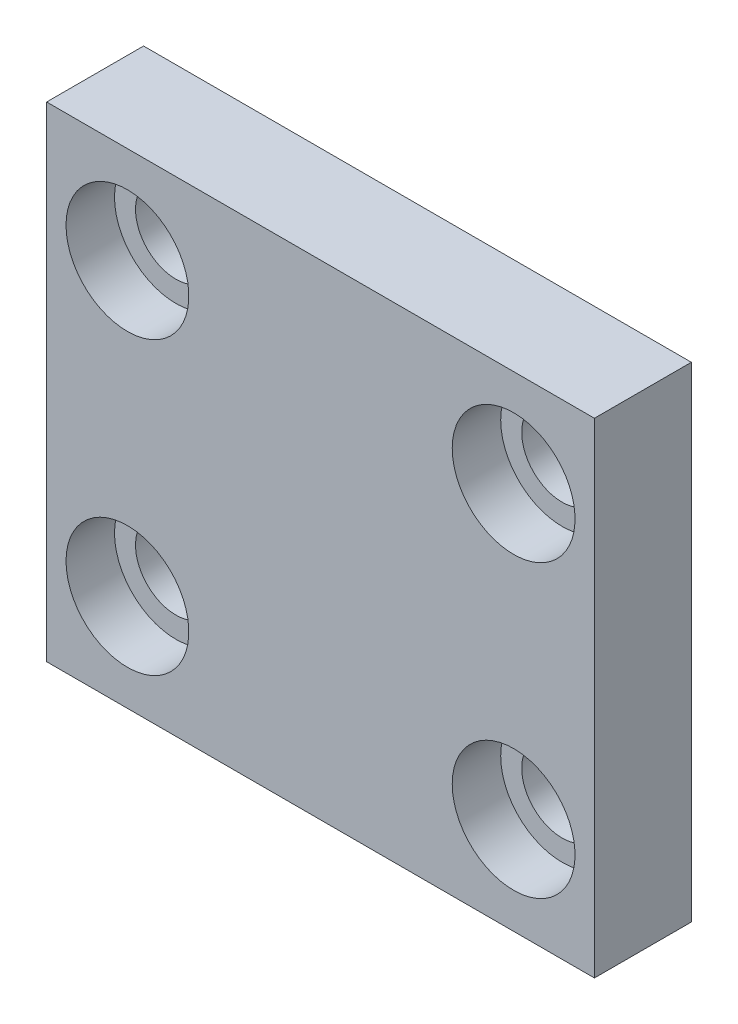
ISO-10303-21;
HEADER;
FILE_DESCRIPTION(('STEP AP214'),'2;1');
FILE_NAME('part.step','',(''),(''),'','','');
FILE_SCHEMA(('AUTOMOTIVE_DESIGN { 1 0 10303 214 1 1 1 1 }'));
ENDSEC;
DATA;
#1=APPLICATION_CONTEXT('core data for automotive mechanical design processes');
#2=APPLICATION_PROTOCOL_DEFINITION('international standard','automotive_design',2000,#1);
#3=PRODUCT_CONTEXT('',#1,'mechanical');
#4=PRODUCT('Part','Part','',(#3));
#5=PRODUCT_RELATED_PRODUCT_CATEGORY('part','',(#4));
#6=PRODUCT_DEFINITION_FORMATION('','',#4);
#7=PRODUCT_DEFINITION_CONTEXT('part definition',#1,'design');
#8=PRODUCT_DEFINITION('design','',#6,#7);
#9=PRODUCT_DEFINITION_SHAPE('','',#8);
#10=(LENGTH_UNIT() NAMED_UNIT(*) SI_UNIT(.MILLI.,.METRE.));
#11=(NAMED_UNIT(*) PLANE_ANGLE_UNIT() SI_UNIT($,.RADIAN.));
#12=(NAMED_UNIT(*) SI_UNIT($,.STERADIAN.) SOLID_ANGLE_UNIT());
#13=UNCERTAINTY_MEASURE_WITH_UNIT(LENGTH_MEASURE(1.E-05),#10,'distance_accuracy_value','');
#14=(GEOMETRIC_REPRESENTATION_CONTEXT(3) GLOBAL_UNCERTAINTY_ASSIGNED_CONTEXT((#13)) GLOBAL_UNIT_ASSIGNED_CONTEXT((#10,
#11,#12)) REPRESENTATION_CONTEXT('',''));
#15=CARTESIAN_POINT('',(0.,0.,0.));
#16=DIRECTION('',(0.,0.,1.));
#17=DIRECTION('',(1.,0.,0.));
#18=AXIS2_PLACEMENT_3D('',#15,#16,#17);
#19=CARTESIAN_POINT('',(16.95,-15.,3.));
#20=DIRECTION('',(-1.,0.,0.));
#21=DIRECTION('',(0.,0.,1.));
#22=AXIS2_PLACEMENT_3D('',#19,#20,#21);
#23=PLANE('',#22);
#24=DIRECTION('',(0.,1.,0.));
#25=VECTOR('',#24,1.);
#26=CARTESIAN_POINT('',(16.95,-15.,0.));
#27=LINE('',#26,#25);
#28=CARTESIAN_POINT('',(16.95,-15.,0.));
#29=VERTEX_POINT('',#28);
#30=CARTESIAN_POINT('',(16.95,15.,0.));
#31=VERTEX_POINT('',#30);
#32=EDGE_CURVE('E89',#29,#31,#27,.T.);
#33=ORIENTED_EDGE('',*,*,#32,.T.);
#34=DIRECTION('',(0.,0.,-1.));
#35=VECTOR('',#34,1.);
#36=CARTESIAN_POINT('',(16.95,15.,3.));
#37=LINE('',#36,#35);
#38=CARTESIAN_POINT('',(16.95,15.,6.));
#39=VERTEX_POINT('',#38);
#40=EDGE_CURVE('E11',#39,#31,#37,.T.);
#41=ORIENTED_EDGE('',*,*,#40,.F.);
#42=DIRECTION('',(0.,1.,0.));
#43=VECTOR('',#42,1.);
#44=CARTESIAN_POINT('',(16.95,-15.,6.));
#45=LINE('',#44,#43);
#46=CARTESIAN_POINT('',(16.95,-15.,6.));
#47=VERTEX_POINT('',#46);
#48=EDGE_CURVE('E87',#47,#39,#45,.T.);
#49=ORIENTED_EDGE('',*,*,#48,.F.);
#50=DIRECTION('',(0.,0.,-1.));
#51=VECTOR('',#50,1.);
#52=CARTESIAN_POINT('',(16.95,-15.,3.));
#53=LINE('',#52,#51);
#54=EDGE_CURVE('E157',#47,#29,#53,.T.);
#55=ORIENTED_EDGE('',*,*,#54,.T.);
#56=EDGE_LOOP('',(#33,#41,#49,#55));
#57=FACE_BOUND('',#56,.T.);
#58=ADVANCED_FACE('F43',(#57),#23,.F.);
#59=CARTESIAN_POINT('',(-16.95,15.,3.));
#60=DIRECTION('',(0.,-1.,0.));
#61=DIRECTION('',(0.,0.,-1.));
#62=AXIS2_PLACEMENT_3D('',#59,#60,#61);
#63=PLANE('',#62);
#64=DIRECTION('',(-1.,0.,0.));
#65=VECTOR('',#64,1.);
#66=CARTESIAN_POINT('',(-16.95,15.,0.));
#67=LINE('',#66,#65);
#68=CARTESIAN_POINT('',(-16.95,15.,0.));
#69=VERTEX_POINT('',#68);
#70=EDGE_CURVE('E150',#31,#69,#67,.T.);
#71=ORIENTED_EDGE('',*,*,#70,.T.);
#72=DIRECTION('',(0.,0.,-1.));
#73=VECTOR('',#72,1.);
#74=CARTESIAN_POINT('',(-16.95,15.,3.));
#75=LINE('',#74,#73);
#76=CARTESIAN_POINT('',(-16.95,15.,6.));
#77=VERTEX_POINT('',#76);
#78=EDGE_CURVE('E51',#77,#69,#75,.T.);
#79=ORIENTED_EDGE('',*,*,#78,.F.);
#80=DIRECTION('',(-1.,0.,0.));
#81=VECTOR('',#80,1.);
#82=CARTESIAN_POINT('',(-16.95,15.,6.));
#83=LINE('',#82,#81);
#84=EDGE_CURVE('E92',#39,#77,#83,.T.);
#85=ORIENTED_EDGE('',*,*,#84,.F.);
#86=ORIENTED_EDGE('',*,*,#40,.T.);
#87=EDGE_LOOP('',(#71,#79,#85,#86));
#88=FACE_BOUND('',#87,.T.);
#89=ADVANCED_FACE('F93',(#88),#63,.F.);
#90=CARTESIAN_POINT('',(-16.95,-15.,3.));
#91=DIRECTION('',(1.,0.,0.));
#92=DIRECTION('',(0.,0.,-1.));
#93=AXIS2_PLACEMENT_3D('',#90,#91,#92);
#94=PLANE('',#93);
#95=DIRECTION('',(0.,-1.,0.));
#96=VECTOR('',#95,1.);
#97=CARTESIAN_POINT('',(-16.95,-15.,0.));
#98=LINE('',#97,#96);
#99=CARTESIAN_POINT('',(-16.95,-15.,0.));
#100=VERTEX_POINT('',#99);
#101=EDGE_CURVE('E66',#69,#100,#98,.T.);
#102=ORIENTED_EDGE('',*,*,#101,.T.);
#103=DIRECTION('',(0.,0.,-1.));
#104=VECTOR('',#103,1.);
#105=CARTESIAN_POINT('',(-16.95,-15.,3.));
#106=LINE('',#105,#104);
#107=CARTESIAN_POINT('',(-16.95,-15.,6.));
#108=VERTEX_POINT('',#107);
#109=EDGE_CURVE('E160',#108,#100,#106,.T.);
#110=ORIENTED_EDGE('',*,*,#109,.F.);
#111=DIRECTION('',(0.,-1.,0.));
#112=VECTOR('',#111,1.);
#113=CARTESIAN_POINT('',(-16.95,-15.,6.));
#114=LINE('',#113,#112);
#115=EDGE_CURVE('E98',#77,#108,#114,.T.);
#116=ORIENTED_EDGE('',*,*,#115,.F.);
#117=ORIENTED_EDGE('',*,*,#78,.T.);
#118=EDGE_LOOP('',(#102,#110,#116,#117));
#119=FACE_BOUND('',#118,.T.);
#120=ADVANCED_FACE('F163',(#119),#94,.F.);
#121=CARTESIAN_POINT('',(-16.95,-15.,3.));
#122=DIRECTION('',(0.,1.,0.));
#123=DIRECTION('',(0.,0.,1.));
#124=AXIS2_PLACEMENT_3D('',#121,#122,#123);
#125=PLANE('',#124);
#126=DIRECTION('',(1.,0.,0.));
#127=VECTOR('',#126,1.);
#128=CARTESIAN_POINT('',(-16.95,-15.,0.));
#129=LINE('',#128,#127);
#130=EDGE_CURVE('E58',#100,#29,#129,.T.);
#131=ORIENTED_EDGE('',*,*,#130,.T.);
#132=ORIENTED_EDGE('',*,*,#54,.F.);
#133=DIRECTION('',(1.,0.,0.));
#134=VECTOR('',#133,1.);
#135=CARTESIAN_POINT('',(-16.95,-15.,6.));
#136=LINE('',#135,#134);
#137=EDGE_CURVE('E103',#108,#47,#136,.T.);
#138=ORIENTED_EDGE('',*,*,#137,.F.);
#139=ORIENTED_EDGE('',*,*,#109,.T.);
#140=EDGE_LOOP('',(#131,#132,#138,#139));
#141=FACE_BOUND('',#140,.T.);
#142=ADVANCED_FACE('F168',(#141),#125,.F.);
#143=CARTESIAN_POINT('',(0.,0.,0.));
#144=DIRECTION('',(0.,0.,-1.));
#145=DIRECTION('',(-1.,0.,0.));
#146=AXIS2_PLACEMENT_3D('',#143,#144,#145);
#147=PLANE('',#146);
#148=CARTESIAN_POINT('',(-11.95,-9.,0.));
#149=DIRECTION('',(0.,0.,1.));
#150=DIRECTION('',(1.,0.,0.));
#151=AXIS2_PLACEMENT_3D('',#148,#149,#150);
#152=CIRCLE('',#151,2.5);
#153=CARTESIAN_POINT('',(-9.45000000000001,-9.,0.));
#154=VERTEX_POINT('',#153);
#155=EDGE_CURVE('E119',#154,#154,#152,.T.);
#156=ORIENTED_EDGE('',*,*,#155,.T.);
#157=EDGE_LOOP('',(#156));
#158=FACE_BOUND('',#157,.T.);
#159=CARTESIAN_POINT('',(11.95,-9.,0.));
#160=DIRECTION('',(0.,0.,1.));
#161=DIRECTION('',(1.,0.,0.));
#162=AXIS2_PLACEMENT_3D('',#159,#160,#161);
#163=CIRCLE('',#162,2.5);
#164=CARTESIAN_POINT('',(14.45,-9.,0.));
#165=VERTEX_POINT('',#164);
#166=EDGE_CURVE('E130',#165,#165,#163,.T.);
#167=ORIENTED_EDGE('',*,*,#166,.T.);
#168=EDGE_LOOP('',(#167));
#169=FACE_BOUND('',#168,.T.);
#170=CARTESIAN_POINT('',(11.95,9.,0.));
#171=DIRECTION('',(0.,0.,1.));
#172=DIRECTION('',(1.,0.,0.));
#173=AXIS2_PLACEMENT_3D('',#170,#171,#172);
#174=CIRCLE('',#173,2.5);
#175=CARTESIAN_POINT('',(14.45,9.,0.));
#176=VERTEX_POINT('',#175);
#177=EDGE_CURVE('E125',#176,#176,#174,.T.);
#178=ORIENTED_EDGE('',*,*,#177,.T.);
#179=EDGE_LOOP('',(#178));
#180=FACE_BOUND('',#179,.T.);
#181=CARTESIAN_POINT('',(-11.95,9.,0.));
#182=DIRECTION('',(0.,0.,1.));
#183=DIRECTION('',(1.,0.,0.));
#184=AXIS2_PLACEMENT_3D('',#181,#182,#183);
#185=CIRCLE('',#184,2.5);
#186=CARTESIAN_POINT('',(-9.45000000000001,9.,0.));
#187=VERTEX_POINT('',#186);
#188=EDGE_CURVE('E129',#187,#187,#185,.T.);
#189=ORIENTED_EDGE('',*,*,#188,.T.);
#190=EDGE_LOOP('',(#189));
#191=FACE_BOUND('',#190,.T.);
#192=ORIENTED_EDGE('',*,*,#32,.F.);
#193=ORIENTED_EDGE('',*,*,#130,.F.);
#194=ORIENTED_EDGE('',*,*,#101,.F.);
#195=ORIENTED_EDGE('',*,*,#70,.F.);
#196=EDGE_LOOP('',(#192,#193,#194,#195));
#197=FACE_BOUND('',#196,.T.);
#198=ADVANCED_FACE('F165',(#158,#169,#180,#191,#197),#147,.T.);
#199=CARTESIAN_POINT('',(-11.95,9.,0.));
#200=DIRECTION('',(0.,0.,1.));
#201=DIRECTION('',(1.,0.,0.));
#202=AXIS2_PLACEMENT_3D('',#199,#200,#201);
#203=CYLINDRICAL_SURFACE('',#202,2.5);
#204=ORIENTED_EDGE('',*,*,#188,.F.);
#205=EDGE_LOOP('',(#204));
#206=FACE_BOUND('',#205,.T.);
#207=CARTESIAN_POINT('',(-11.95,9.,3.));
#208=DIRECTION('',(0.,0.,1.));
#209=DIRECTION('',(1.,0.,0.));
#210=AXIS2_PLACEMENT_3D('',#207,#208,#209);
#211=CIRCLE('',#210,2.5);
#212=CARTESIAN_POINT('',(-9.45000000000001,9.,3.));
#213=VERTEX_POINT('',#212);
#214=EDGE_CURVE('E105',#213,#213,#211,.T.);
#215=ORIENTED_EDGE('',*,*,#214,.T.);
#216=EDGE_LOOP('',(#215));
#217=FACE_BOUND('',#216,.T.);
#218=ADVANCED_FACE('F167',(#206,#217),#203,.F.);
#219=CARTESIAN_POINT('',(11.95,9.,0.));
#220=DIRECTION('',(0.,0.,1.));
#221=DIRECTION('',(1.,0.,0.));
#222=AXIS2_PLACEMENT_3D('',#219,#220,#221);
#223=CYLINDRICAL_SURFACE('',#222,2.5);
#224=ORIENTED_EDGE('',*,*,#177,.F.);
#225=EDGE_LOOP('',(#224));
#226=FACE_BOUND('',#225,.T.);
#227=CARTESIAN_POINT('',(11.95,9.,3.));
#228=DIRECTION('',(0.,0.,1.));
#229=DIRECTION('',(1.,0.,0.));
#230=AXIS2_PLACEMENT_3D('',#227,#228,#229);
#231=CIRCLE('',#230,2.5);
#232=CARTESIAN_POINT('',(14.45,9.,3.));
#233=VERTEX_POINT('',#232);
#234=EDGE_CURVE('E120',#233,#233,#231,.T.);
#235=ORIENTED_EDGE('',*,*,#234,.T.);
#236=EDGE_LOOP('',(#235));
#237=FACE_BOUND('',#236,.T.);
#238=ADVANCED_FACE('F175',(#226,#237),#223,.F.);
#239=CARTESIAN_POINT('',(11.95,-9.,0.));
#240=DIRECTION('',(0.,0.,1.));
#241=DIRECTION('',(1.,0.,0.));
#242=AXIS2_PLACEMENT_3D('',#239,#240,#241);
#243=CYLINDRICAL_SURFACE('',#242,2.5);
#244=ORIENTED_EDGE('',*,*,#166,.F.);
#245=EDGE_LOOP('',(#244));
#246=FACE_BOUND('',#245,.T.);
#247=CARTESIAN_POINT('',(11.95,-9.,3.));
#248=DIRECTION('',(0.,0.,1.));
#249=DIRECTION('',(1.,0.,0.));
#250=AXIS2_PLACEMENT_3D('',#247,#248,#249);
#251=CIRCLE('',#250,2.5);
#252=CARTESIAN_POINT('',(14.45,-9.,3.));
#253=VERTEX_POINT('',#252);
#254=EDGE_CURVE('E124',#253,#253,#251,.T.);
#255=ORIENTED_EDGE('',*,*,#254,.T.);
#256=EDGE_LOOP('',(#255));
#257=FACE_BOUND('',#256,.T.);
#258=ADVANCED_FACE('F312',(#246,#257),#243,.F.);
#259=CARTESIAN_POINT('',(-11.95,-9.,0.));
#260=DIRECTION('',(0.,0.,1.));
#261=DIRECTION('',(1.,0.,0.));
#262=AXIS2_PLACEMENT_3D('',#259,#260,#261);
#263=CYLINDRICAL_SURFACE('',#262,2.5);
#264=ORIENTED_EDGE('',*,*,#155,.F.);
#265=EDGE_LOOP('',(#264));
#266=FACE_BOUND('',#265,.T.);
#267=CARTESIAN_POINT('',(-11.95,-9.,3.));
#268=DIRECTION('',(0.,0.,1.));
#269=DIRECTION('',(1.,0.,0.));
#270=AXIS2_PLACEMENT_3D('',#267,#268,#269);
#271=CIRCLE('',#270,2.5);
#272=CARTESIAN_POINT('',(-9.45000000000001,-9.,3.));
#273=VERTEX_POINT('',#272);
#274=EDGE_CURVE('E134',#273,#273,#271,.T.);
#275=ORIENTED_EDGE('',*,*,#274,.T.);
#276=EDGE_LOOP('',(#275));
#277=FACE_BOUND('',#276,.T.);
#278=ADVANCED_FACE('F229',(#266,#277),#263,.F.);
#279=CARTESIAN_POINT('',(0.,0.,6.));
#280=DIRECTION('',(0.,0.,-1.));
#281=DIRECTION('',(-1.,0.,0.));
#282=AXIS2_PLACEMENT_3D('',#279,#280,#281);
#283=PLANE('',#282);
#284=CARTESIAN_POINT('',(11.95,9.,6.));
#285=DIRECTION('',(0.,0.,-1.));
#286=DIRECTION('',(-1.,0.,0.));
#287=AXIS2_PLACEMENT_3D('',#284,#285,#286);
#288=CIRCLE('',#287,3.8);
#289=CARTESIAN_POINT('',(8.14999999999999,9.,6.));
#290=VERTEX_POINT('',#289);
#291=EDGE_CURVE('E141',#290,#290,#288,.T.);
#292=ORIENTED_EDGE('',*,*,#291,.T.);
#293=EDGE_LOOP('',(#292));
#294=FACE_BOUND('',#293,.T.);
#295=CARTESIAN_POINT('',(11.95,-9.,6.));
#296=DIRECTION('',(0.,0.,-1.));
#297=DIRECTION('',(-1.,0.,0.));
#298=AXIS2_PLACEMENT_3D('',#295,#296,#297);
#299=CIRCLE('',#298,3.8);
#300=CARTESIAN_POINT('',(8.14999999999999,-9.,6.));
#301=VERTEX_POINT('',#300);
#302=EDGE_CURVE('E415',#301,#301,#299,.T.);
#303=ORIENTED_EDGE('',*,*,#302,.T.);
#304=EDGE_LOOP('',(#303));
#305=FACE_BOUND('',#304,.T.);
#306=CARTESIAN_POINT('',(-11.95,-9.,6.));
#307=DIRECTION('',(0.,0.,-1.));
#308=DIRECTION('',(-1.,0.,0.));
#309=AXIS2_PLACEMENT_3D('',#306,#307,#308);
#310=CIRCLE('',#309,3.8);
#311=CARTESIAN_POINT('',(-15.75,-9.,6.));
#312=VERTEX_POINT('',#311);
#313=EDGE_CURVE('E425',#312,#312,#310,.T.);
#314=ORIENTED_EDGE('',*,*,#313,.T.);
#315=EDGE_LOOP('',(#314));
#316=FACE_BOUND('',#315,.T.);
#317=CARTESIAN_POINT('',(-11.95,9.,6.));
#318=DIRECTION('',(0.,0.,-1.));
#319=DIRECTION('',(-1.,0.,0.));
#320=AXIS2_PLACEMENT_3D('',#317,#318,#319);
#321=CIRCLE('',#320,3.8);
#322=CARTESIAN_POINT('',(-15.75,9.,6.));
#323=VERTEX_POINT('',#322);
#324=EDGE_CURVE('E109',#323,#323,#321,.T.);
#325=ORIENTED_EDGE('',*,*,#324,.T.);
#326=EDGE_LOOP('',(#325));
#327=FACE_BOUND('',#326,.T.);
#328=ORIENTED_EDGE('',*,*,#48,.T.);
#329=ORIENTED_EDGE('',*,*,#84,.T.);
#330=ORIENTED_EDGE('',*,*,#115,.T.);
#331=ORIENTED_EDGE('',*,*,#137,.T.);
#332=EDGE_LOOP('',(#328,#329,#330,#331));
#333=FACE_BOUND('',#332,.T.);
#334=ADVANCED_FACE('F101',(#294,#305,#316,#327,#333),#283,.F.);
#335=CARTESIAN_POINT('',(-11.95,9.,3.));
#336=DIRECTION('',(0.,0.,-1.));
#337=DIRECTION('',(-1.,0.,0.));
#338=AXIS2_PLACEMENT_3D('',#335,#336,#337);
#339=PLANE('',#338);
#340=CARTESIAN_POINT('',(-11.95,9.,3.));
#341=DIRECTION('',(0.,0.,-1.));
#342=DIRECTION('',(-1.,0.,0.));
#343=AXIS2_PLACEMENT_3D('',#340,#341,#342);
#344=CIRCLE('',#343,3.8);
#345=CARTESIAN_POINT('',(-15.75,9.,3.));
#346=VERTEX_POINT('',#345);
#347=EDGE_CURVE('E112',#346,#346,#344,.T.);
#348=ORIENTED_EDGE('',*,*,#347,.F.);
#349=EDGE_LOOP('',(#348));
#350=FACE_BOUND('',#349,.T.);
#351=ORIENTED_EDGE('',*,*,#214,.F.);
#352=EDGE_LOOP('',(#351));
#353=FACE_BOUND('',#352,.T.);
#354=ADVANCED_FACE('F201',(#350,#353),#339,.F.);
#355=CARTESIAN_POINT('',(-11.95,9.,6.));
#356=DIRECTION('',(0.,0.,-1.));
#357=DIRECTION('',(-1.,0.,0.));
#358=AXIS2_PLACEMENT_3D('',#355,#356,#357);
#359=CYLINDRICAL_SURFACE('',#358,3.8);
#360=ORIENTED_EDGE('',*,*,#324,.F.);
#361=EDGE_LOOP('',(#360));
#362=FACE_BOUND('',#361,.T.);
#363=ORIENTED_EDGE('',*,*,#347,.T.);
#364=EDGE_LOOP('',(#363));
#365=FACE_BOUND('',#364,.T.);
#366=ADVANCED_FACE('F206',(#362,#365),#359,.F.);
#367=CARTESIAN_POINT('',(-11.95,-9.,3.));
#368=DIRECTION('',(0.,0.,-1.));
#369=DIRECTION('',(-1.,0.,0.));
#370=AXIS2_PLACEMENT_3D('',#367,#368,#369);
#371=PLANE('',#370);
#372=CARTESIAN_POINT('',(-11.95,-9.,3.));
#373=DIRECTION('',(0.,0.,-1.));
#374=DIRECTION('',(-1.,0.,0.));
#375=AXIS2_PLACEMENT_3D('',#372,#373,#374);
#376=CIRCLE('',#375,3.8);
#377=CARTESIAN_POINT('',(-15.75,-9.,3.));
#378=VERTEX_POINT('',#377);
#379=EDGE_CURVE('E421',#378,#378,#376,.T.);
#380=ORIENTED_EDGE('',*,*,#379,.F.);
#381=EDGE_LOOP('',(#380));
#382=FACE_BOUND('',#381,.T.);
#383=ORIENTED_EDGE('',*,*,#274,.F.);
#384=EDGE_LOOP('',(#383));
#385=FACE_BOUND('',#384,.T.);
#386=ADVANCED_FACE('F218',(#382,#385),#371,.F.);
#387=CARTESIAN_POINT('',(-11.95,-9.,6.));
#388=DIRECTION('',(0.,0.,-1.));
#389=DIRECTION('',(-1.,0.,0.));
#390=AXIS2_PLACEMENT_3D('',#387,#388,#389);
#391=CYLINDRICAL_SURFACE('',#390,3.8);
#392=ORIENTED_EDGE('',*,*,#313,.F.);
#393=EDGE_LOOP('',(#392));
#394=FACE_BOUND('',#393,.T.);
#395=ORIENTED_EDGE('',*,*,#379,.T.);
#396=EDGE_LOOP('',(#395));
#397=FACE_BOUND('',#396,.T.);
#398=ADVANCED_FACE('F239',(#394,#397),#391,.F.);
#399=CARTESIAN_POINT('',(11.95,-9.,3.));
#400=DIRECTION('',(0.,0.,-1.));
#401=DIRECTION('',(-1.,0.,0.));
#402=AXIS2_PLACEMENT_3D('',#399,#400,#401);
#403=PLANE('',#402);
#404=CARTESIAN_POINT('',(11.95,-9.,3.));
#405=DIRECTION('',(0.,0.,-1.));
#406=DIRECTION('',(-1.,0.,0.));
#407=AXIS2_PLACEMENT_3D('',#404,#405,#406);
#408=CIRCLE('',#407,3.8);
#409=CARTESIAN_POINT('',(8.14999999999999,-9.,3.));
#410=VERTEX_POINT('',#409);
#411=EDGE_CURVE('E409',#410,#410,#408,.T.);
#412=ORIENTED_EDGE('',*,*,#411,.F.);
#413=EDGE_LOOP('',(#412));
#414=FACE_BOUND('',#413,.T.);
#415=ORIENTED_EDGE('',*,*,#254,.F.);
#416=EDGE_LOOP('',(#415));
#417=FACE_BOUND('',#416,.T.);
#418=ADVANCED_FACE('F250',(#414,#417),#403,.F.);
#419=CARTESIAN_POINT('',(11.95,-9.,6.));
#420=DIRECTION('',(0.,0.,-1.));
#421=DIRECTION('',(-1.,0.,0.));
#422=AXIS2_PLACEMENT_3D('',#419,#420,#421);
#423=CYLINDRICAL_SURFACE('',#422,3.8);
#424=ORIENTED_EDGE('',*,*,#302,.F.);
#425=EDGE_LOOP('',(#424));
#426=FACE_BOUND('',#425,.T.);
#427=ORIENTED_EDGE('',*,*,#411,.T.);
#428=EDGE_LOOP('',(#427));
#429=FACE_BOUND('',#428,.T.);
#430=ADVANCED_FACE('F261',(#426,#429),#423,.F.);
#431=CARTESIAN_POINT('',(11.95,9.,3.));
#432=DIRECTION('',(0.,0.,-1.));
#433=DIRECTION('',(-1.,0.,0.));
#434=AXIS2_PLACEMENT_3D('',#431,#432,#433);
#435=PLANE('',#434);
#436=CARTESIAN_POINT('',(11.95,9.,3.));
#437=DIRECTION('',(0.,0.,-1.));
#438=DIRECTION('',(-1.,0.,0.));
#439=AXIS2_PLACEMENT_3D('',#436,#437,#438);
#440=CIRCLE('',#439,3.8);
#441=CARTESIAN_POINT('',(8.14999999999999,9.,3.));
#442=VERTEX_POINT('',#441);
#443=EDGE_CURVE('E407',#442,#442,#440,.T.);
#444=ORIENTED_EDGE('',*,*,#443,.F.);
#445=EDGE_LOOP('',(#444));
#446=FACE_BOUND('',#445,.T.);
#447=ORIENTED_EDGE('',*,*,#234,.F.);
#448=EDGE_LOOP('',(#447));
#449=FACE_BOUND('',#448,.T.);
#450=ADVANCED_FACE('F272',(#446,#449),#435,.F.);
#451=CARTESIAN_POINT('',(11.95,9.,6.));
#452=DIRECTION('',(0.,0.,-1.));
#453=DIRECTION('',(-1.,0.,0.));
#454=AXIS2_PLACEMENT_3D('',#451,#452,#453);
#455=CYLINDRICAL_SURFACE('',#454,3.8);
#456=ORIENTED_EDGE('',*,*,#291,.F.);
#457=EDGE_LOOP('',(#456));
#458=FACE_BOUND('',#457,.T.);
#459=ORIENTED_EDGE('',*,*,#443,.T.);
#460=EDGE_LOOP('',(#459));
#461=FACE_BOUND('',#460,.T.);
#462=ADVANCED_FACE('F283',(#458,#461),#455,.F.);
#463=CLOSED_SHELL('',(#58,#89,#120,#142,#198,#218,#238,#258,#278,#334,#354,#366,#386,#398,#418,
#430,#450,#462));
#464=MANIFOLD_SOLID_BREP('B2',#463);
#465=ADVANCED_BREP_SHAPE_REPRESENTATION('',(#18,#464),#14);
#466=SHAPE_DEFINITION_REPRESENTATION(#9,#465);
ENDSEC;
END-ISO-10303-21;
